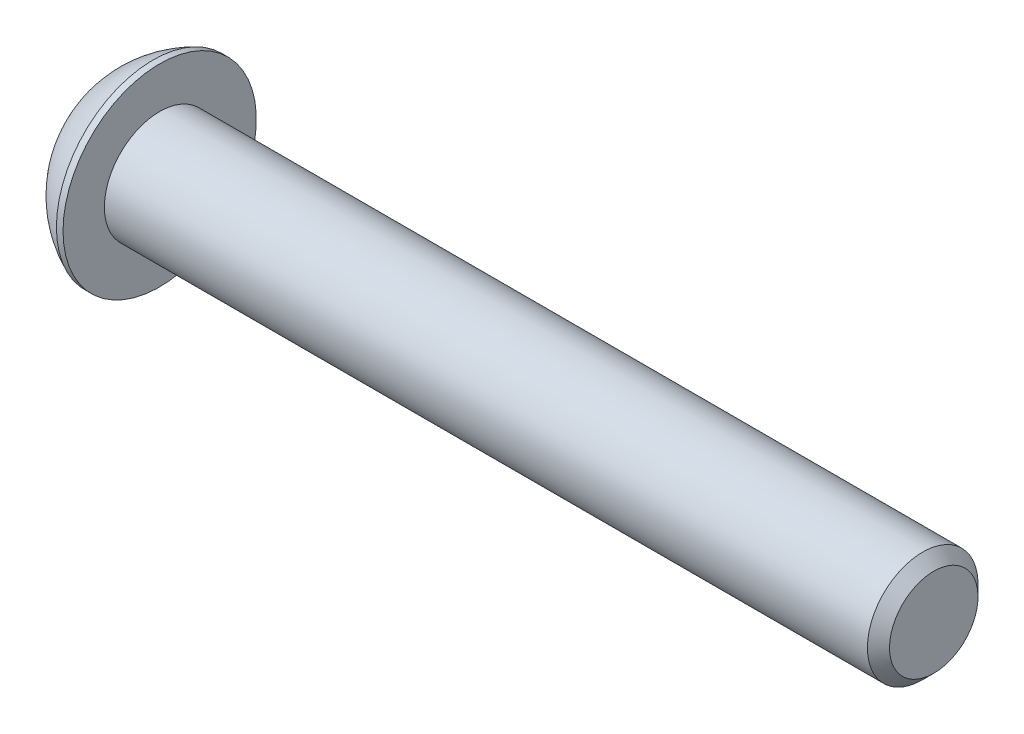
ISO-10303-21;
HEADER;
FILE_DESCRIPTION(('STEP AP214'),'2;1');
FILE_NAME('part.step','',(''),(''),'','','');
FILE_SCHEMA(('AUTOMOTIVE_DESIGN { 1 0 10303 214 1 1 1 1 }'));
ENDSEC;
DATA;
#1=APPLICATION_CONTEXT('core data for automotive mechanical design processes');
#2=APPLICATION_PROTOCOL_DEFINITION('international standard','automotive_design',2000,#1);
#3=PRODUCT_CONTEXT('',#1,'mechanical');
#4=PRODUCT('Part','Part','',(#3));
#5=PRODUCT_RELATED_PRODUCT_CATEGORY('part','',(#4));
#6=PRODUCT_DEFINITION_FORMATION('','',#4);
#7=PRODUCT_DEFINITION_CONTEXT('part definition',#1,'design');
#8=PRODUCT_DEFINITION('design','',#6,#7);
#9=PRODUCT_DEFINITION_SHAPE('','',#8);
#10=(LENGTH_UNIT() NAMED_UNIT(*) SI_UNIT(.MILLI.,.METRE.));
#11=(NAMED_UNIT(*) PLANE_ANGLE_UNIT() SI_UNIT($,.RADIAN.));
#12=(NAMED_UNIT(*) SI_UNIT($,.STERADIAN.) SOLID_ANGLE_UNIT());
#13=UNCERTAINTY_MEASURE_WITH_UNIT(LENGTH_MEASURE(1.E-05),#10,'distance_accuracy_value','');
#14=(GEOMETRIC_REPRESENTATION_CONTEXT(3) GLOBAL_UNCERTAINTY_ASSIGNED_CONTEXT((#13)) GLOBAL_UNIT_ASSIGNED_CONTEXT((#10,
#11,#12)) REPRESENTATION_CONTEXT('',''));
#15=CARTESIAN_POINT('',(0.,0.,0.));
#16=DIRECTION('',(0.,0.,1.));
#17=DIRECTION('',(1.,0.,0.));
#18=AXIS2_PLACEMENT_3D('',#15,#16,#17);
#19=CARTESIAN_POINT('',(1.32079999432833,0.,0.));
#20=DIRECTION('',(-1.,0.,0.));
#21=DIRECTION('',(0.,0.,1.));
#22=AXIS2_PLACEMENT_3D('',#19,#20,#21);
#23=CONICAL_SURFACE('',#22,1.19379999672553,1.04719755119985);
#24=CARTESIAN_POINT('',(2.01004074379096,0.,4.44089209850063E-13));
#25=VERTEX_POINT('',#24);
#26=VERTEX_LOOP('',#25);
#27=FACE_BOUND('',#26,.T.);
#28=CARTESIAN_POINT('',(1.32079999432833,0.,0.));
#29=DIRECTION('',(-1.,0.,0.));
#30=DIRECTION('',(0.,0.,1.));
#31=AXIS2_PLACEMENT_3D('',#28,#29,#30);
#32=CIRCLE('',#31,1.19379999672553);
#33=CARTESIAN_POINT('',(1.32079999432833,0.,1.19379999672553));
#34=VERTEX_POINT('',#33);
#35=EDGE_CURVE('E20',#34,#34,#32,.T.);
#36=ORIENTED_EDGE('',*,*,#35,.T.);
#37=EDGE_LOOP('',(#36));
#38=FACE_BOUND('',#37,.T.);
#39=ADVANCED_FACE('F17',(#27,#38),#23,.F.);
#40=CARTESIAN_POINT('',(1.3208,-2.29135888085,0.));
#41=DIRECTION('',(1.,0.,0.));
#42=DIRECTION('',(0.,0.,-1.));
#43=AXIS2_PLACEMENT_3D('',#40,#41,#42);
#44=PLANE('',#43);
#45=ORIENTED_EDGE('',*,*,#35,.F.);
#46=EDGE_LOOP('',(#45));
#47=FACE_BOUND('',#46,.T.);
#48=DIRECTION('',(0.,1.,0.));
#49=VECTOR('',#48,1.);
#50=CARTESIAN_POINT('',(1.3208,-1.14567944042,1.984375));
#51=LINE('',#50,#49);
#52=CARTESIAN_POINT('',(1.3208,1.1456794404025,1.984375));
#53=VERTEX_POINT('',#52);
#54=CARTESIAN_POINT('',(1.3208,-1.14567944045803,1.98437500000826));
#55=VERTEX_POINT('',#54);
#56=EDGE_CURVE('E134',#53,#55,#51,.F.);
#57=ORIENTED_EDGE('',*,*,#56,.F.);
#58=DIRECTION('',(0.,0.50000000000019,-0.866025403784329));
#59=VECTOR('',#58,1.);
#60=CARTESIAN_POINT('',(1.3208,1.14567944042,1.984375));
#61=LINE('',#60,#59);
#62=CARTESIAN_POINT('',(1.3208,2.29135888083945,1.55612149685055E-11));
#63=VERTEX_POINT('',#62);
#64=EDGE_CURVE('E116',#63,#53,#61,.F.);
#65=ORIENTED_EDGE('',*,*,#64,.F.);
#66=DIRECTION('',(0.,-0.50000000000019,-0.866025403784329));
#67=VECTOR('',#66,1.);
#68=CARTESIAN_POINT('',(1.3208,2.29135888085,0.));
#69=LINE('',#68,#67);
#70=CARTESIAN_POINT('',(1.3208,1.1456794404168,-1.98437500000826));
#71=VERTEX_POINT('',#70);
#72=EDGE_CURVE('E88',#71,#63,#69,.F.);
#73=ORIENTED_EDGE('',*,*,#72,.F.);
#74=DIRECTION('',(0.,1.,0.));
#75=VECTOR('',#74,1.);
#76=CARTESIAN_POINT('',(1.3208,1.14567944042,-1.984375));
#77=LINE('',#76,#75);
#78=CARTESIAN_POINT('',(1.3208,-1.1456794404025,-1.984375));
#79=VERTEX_POINT('',#78);
#80=EDGE_CURVE('E85',#79,#71,#77,.T.);
#81=ORIENTED_EDGE('',*,*,#80,.F.);
#82=DIRECTION('',(0.,-0.50000000000019,0.866025403784329));
#83=VECTOR('',#82,1.);
#84=CARTESIAN_POINT('',(1.3208,-1.14567944042,-1.984375));
#85=LINE('',#84,#83);
#86=CARTESIAN_POINT('',(1.3208,-2.29135888083945,-1.55606780336135E-11));
#87=VERTEX_POINT('',#86);
#88=EDGE_CURVE('E124',#87,#79,#85,.F.);
#89=ORIENTED_EDGE('',*,*,#88,.F.);
#90=DIRECTION('',(0.,0.50000000000019,0.866025403784329));
#91=VECTOR('',#90,1.);
#92=CARTESIAN_POINT('',(1.3208,-2.29135888085,0.));
#93=LINE('',#92,#91);
#94=EDGE_CURVE('E129',#55,#87,#93,.F.);
#95=ORIENTED_EDGE('',*,*,#94,.F.);
#96=EDGE_LOOP('',(#57,#65,#73,#81,#89,#95));
#97=FACE_BOUND('',#96,.T.);
#98=ADVANCED_FACE('F173',(#47,#97),#44,.F.);
#99=CARTESIAN_POINT('',(1.3208,-1.14567944042,1.984375));
#100=DIRECTION('',(0.,0.,-1.));
#101=DIRECTION('',(0.,1.,0.));
#102=AXIS2_PLACEMENT_3D('',#99,#100,#101);
#103=PLANE('',#102);
#104=ORIENTED_EDGE('',*,*,#56,.T.);
#105=DIRECTION('',(1.,0.,0.));
#106=VECTOR('',#105,1.);
#107=CARTESIAN_POINT('',(1.3208,-1.14567944040719,1.98437500003302));
#108=LINE('',#107,#106);
#109=CARTESIAN_POINT('',(0.,-1.1456794404393,1.98437500000826));
#110=VERTEX_POINT('',#109);
#111=EDGE_CURVE('E131',#110,#55,#108,.T.);
#112=ORIENTED_EDGE('',*,*,#111,.F.);
#113=DIRECTION('',(0.,1.,0.));
#114=VECTOR('',#113,1.);
#115=CARTESIAN_POINT('',(0.,0.,1.984375));
#116=LINE('',#115,#114);
#117=CARTESIAN_POINT('',(0.,1.1456794403675,1.984375));
#118=VERTEX_POINT('',#117);
#119=EDGE_CURVE('E110',#118,#110,#116,.F.);
#120=ORIENTED_EDGE('',*,*,#119,.F.);
#121=DIRECTION('',(1.,0.,0.));
#122=VECTOR('',#121,1.);
#123=CARTESIAN_POINT('',(1.3208,1.14567944042,1.984375));
#124=LINE('',#123,#122);
#125=EDGE_CURVE('E113',#53,#118,#124,.F.);
#126=ORIENTED_EDGE('',*,*,#125,.F.);
#127=EDGE_LOOP('',(#104,#112,#120,#126));
#128=FACE_BOUND('',#127,.T.);
#129=ADVANCED_FACE('F170',(#128),#103,.T.);
#130=CARTESIAN_POINT('',(1.3208,-2.29135888085,0.));
#131=DIRECTION('',(0.,0.866025403784329,-0.50000000000019));
#132=DIRECTION('',(0.,0.50000000000019,0.866025403784329));
#133=AXIS2_PLACEMENT_3D('',#130,#131,#132);
#134=PLANE('',#133);
#135=ORIENTED_EDGE('',*,*,#94,.T.);
#136=DIRECTION('',(1.,0.,0.));
#137=VECTOR('',#136,1.);
#138=CARTESIAN_POINT('',(1.3208,-2.29135888080781,-6.22431793606548E-11));
#139=LINE('',#138,#137);
#140=CARTESIAN_POINT('',(0.,-2.29135888080195,-1.55607234461392E-11));
#141=VERTEX_POINT('',#140);
#142=EDGE_CURVE('E126',#141,#87,#139,.T.);
#143=ORIENTED_EDGE('',*,*,#142,.F.);
#144=DIRECTION('',(0.,-0.499999999976052,-0.866025403798265));
#145=VECTOR('',#144,1.);
#146=CARTESIAN_POINT('',(0.,-1.14567944035,1.984375));
#147=LINE('',#146,#145);
#148=EDGE_CURVE('E105',#110,#141,#147,.T.);
#149=ORIENTED_EDGE('',*,*,#148,.F.);
#150=ORIENTED_EDGE('',*,*,#111,.T.);
#151=EDGE_LOOP('',(#135,#143,#149,#150));
#152=FACE_BOUND('',#151,.T.);
#153=ADVANCED_FACE('F166',(#152),#134,.T.);
#154=CARTESIAN_POINT('',(1.3208,-1.14567944042,-1.984375));
#155=DIRECTION('',(0.,0.866025403784329,0.50000000000019));
#156=DIRECTION('',(0.,-0.50000000000019,0.866025403784329));
#157=AXIS2_PLACEMENT_3D('',#154,#155,#156);
#158=PLANE('',#157);
#159=ORIENTED_EDGE('',*,*,#88,.T.);
#160=DIRECTION('',(1.,0.,0.));
#161=VECTOR('',#160,1.);
#162=CARTESIAN_POINT('',(1.3208,-1.14567944035,-1.984375));
#163=LINE('',#162,#161);
#164=CARTESIAN_POINT('',(0.,-1.145679440385,-1.984375));
#165=VERTEX_POINT('',#164);
#166=EDGE_CURVE('E122',#165,#79,#163,.T.);
#167=ORIENTED_EDGE('',*,*,#166,.F.);
#168=DIRECTION('',(0.,0.499999999976052,-0.866025403798265));
#169=VECTOR('',#168,1.);
#170=CARTESIAN_POINT('',(0.,-2.2913588807,0.));
#171=LINE('',#170,#169);
#172=EDGE_CURVE('E103',#141,#165,#171,.T.);
#173=ORIENTED_EDGE('',*,*,#172,.F.);
#174=ORIENTED_EDGE('',*,*,#142,.T.);
#175=EDGE_LOOP('',(#159,#167,#173,#174));
#176=FACE_BOUND('',#175,.T.);
#177=ADVANCED_FACE('F163',(#176),#158,.T.);
#178=CARTESIAN_POINT('',(1.3208,1.14567944042,-1.984375));
#179=DIRECTION('',(0.,0.,1.));
#180=DIRECTION('',(1.,0.,0.));
#181=AXIS2_PLACEMENT_3D('',#178,#179,#180);
#182=PLANE('',#181);
#183=ORIENTED_EDGE('',*,*,#80,.T.);
#184=DIRECTION('',(1.,0.,0.));
#185=VECTOR('',#184,1.);
#186=CARTESIAN_POINT('',(1.3208,1.14567944040719,-1.98437500003302));
#187=LINE('',#186,#185);
#188=CARTESIAN_POINT('',(0.,1.1456794403993,-1.98437500000826));
#189=VERTEX_POINT('',#188);
#190=EDGE_CURVE('E77',#189,#71,#187,.T.);
#191=ORIENTED_EDGE('',*,*,#190,.F.);
#192=DIRECTION('',(0.,1.,0.));
#193=VECTOR('',#192,1.);
#194=CARTESIAN_POINT('',(0.,0.,-1.984375));
#195=LINE('',#194,#193);
#196=EDGE_CURVE('E82',#165,#189,#195,.T.);
#197=ORIENTED_EDGE('',*,*,#196,.F.);
#198=ORIENTED_EDGE('',*,*,#166,.T.);
#199=EDGE_LOOP('',(#183,#191,#197,#198));
#200=FACE_BOUND('',#199,.T.);
#201=ADVANCED_FACE('F79',(#200),#182,.T.);
#202=CARTESIAN_POINT('',(1.3208,2.29135888085,0.));
#203=DIRECTION('',(0.,-0.866025403784329,0.50000000000019));
#204=DIRECTION('',(0.,-0.50000000000019,-0.866025403784329));
#205=AXIS2_PLACEMENT_3D('',#202,#203,#204);
#206=PLANE('',#205);
#207=ORIENTED_EDGE('',*,*,#72,.T.);
#208=DIRECTION('',(1.,0.,0.));
#209=VECTOR('',#208,1.);
#210=CARTESIAN_POINT('',(1.3208,2.29135888080781,6.22431793606548E-11));
#211=LINE('',#210,#209);
#212=CARTESIAN_POINT('',(0.,2.29135888080195,1.55609402865737E-11));
#213=VERTEX_POINT('',#212);
#214=EDGE_CURVE('E94',#213,#63,#211,.T.);
#215=ORIENTED_EDGE('',*,*,#214,.F.);
#216=DIRECTION('',(0.,0.499999999976052,0.866025403798265));
#217=VECTOR('',#216,1.);
#218=CARTESIAN_POINT('',(0.,1.14567944035,-1.984375));
#219=LINE('',#218,#217);
#220=EDGE_CURVE('E91',#189,#213,#219,.T.);
#221=ORIENTED_EDGE('',*,*,#220,.F.);
#222=ORIENTED_EDGE('',*,*,#190,.T.);
#223=EDGE_LOOP('',(#207,#215,#221,#222));
#224=FACE_BOUND('',#223,.T.);
#225=ADVANCED_FACE('F92',(#224),#206,.T.);
#226=CARTESIAN_POINT('',(1.3208,1.14567944042,1.984375));
#227=DIRECTION('',(0.,-0.866025403784329,-0.50000000000019));
#228=DIRECTION('',(0.,0.50000000000019,-0.866025403784329));
#229=AXIS2_PLACEMENT_3D('',#226,#227,#228);
#230=PLANE('',#229);
#231=ORIENTED_EDGE('',*,*,#64,.T.);
#232=ORIENTED_EDGE('',*,*,#125,.T.);
#233=DIRECTION('',(0.,-0.499999999976052,0.866025403798265));
#234=VECTOR('',#233,1.);
#235=CARTESIAN_POINT('',(0.,2.2913588807,0.));
#236=LINE('',#235,#234);
#237=EDGE_CURVE('E98',#213,#118,#236,.T.);
#238=ORIENTED_EDGE('',*,*,#237,.F.);
#239=ORIENTED_EDGE('',*,*,#214,.T.);
#240=EDGE_LOOP('',(#231,#232,#238,#239));
#241=FACE_BOUND('',#240,.T.);
#242=ADVANCED_FACE('F155',(#241),#230,.T.);
#243=CARTESIAN_POINT('',(0.,0.,0.));
#244=DIRECTION('',(-1.,0.,0.));
#245=DIRECTION('',(0.,0.,1.));
#246=AXIS2_PLACEMENT_3D('',#243,#244,#245);
#247=PLANE('',#246);
#248=ORIENTED_EDGE('',*,*,#220,.T.);
#249=ORIENTED_EDGE('',*,*,#237,.T.);
#250=ORIENTED_EDGE('',*,*,#119,.T.);
#251=ORIENTED_EDGE('',*,*,#148,.T.);
#252=ORIENTED_EDGE('',*,*,#172,.T.);
#253=ORIENTED_EDGE('',*,*,#196,.T.);
#254=EDGE_LOOP('',(#248,#249,#250,#251,#252,#253));
#255=FACE_BOUND('',#254,.T.);
#256=CARTESIAN_POINT('',(0.,0.,2.77495000000498));
#257=CARTESIAN_POINT('',(0.,-0.0780476189418023,2.7749574777346));
#258=CARTESIAN_POINT('',(0.,-0.156091690997,2.77165730271175));
#259=CARTESIAN_POINT('',(0.,-0.311621483993028,2.75849951311291));
#260=CARTESIAN_POINT('',(0.,-0.38910723148015,2.74864221241182));
#261=CARTESIAN_POINT('',(0.,-0.542923175998717,2.72243714479626));
#262=CARTESIAN_POINT('',(0.,-0.619254139371762,2.70609389762394));
#263=CARTESIAN_POINT('',(0.,-0.770249304507315,2.66704952043296));
#264=CARTESIAN_POINT('',(0.,-0.844913526539225,2.64434846777771));
#265=CARTESIAN_POINT('',(0.,-1.06568596776161,2.5668918761079));
#266=CARTESIAN_POINT('',(0.,-1.20863620572707,2.50277224258278));
#267=CARTESIAN_POINT('',(0.,-1.48162845017614,2.35149042805168));
#268=CARTESIAN_POINT('',(0.,-1.61167355634549,2.26433379882055));
#269=CARTESIAN_POINT('',(0.,-1.85530048203785,2.06942681171443));
#270=CARTESIAN_POINT('',(0.,-1.96888346338675,1.96167790839914));
#271=CARTESIAN_POINT('',(0.,-2.17638612604483,1.72859715533842));
#272=CARTESIAN_POINT('',(0.,-2.27029827782891,1.60325860323943));
#273=CARTESIAN_POINT('',(0.,-2.43577545577329,1.33855376914359));
#274=CARTESIAN_POINT('',(0.,-2.50733172131476,1.19918201616334));
#275=CARTESIAN_POINT('',(0.,-2.62594987301431,0.910512315267797));
#276=CARTESIAN_POINT('',(0.,-2.67304017955261,0.761226112752659));
#277=CARTESIAN_POINT('',(0.,-2.72974480799017,0.509262206015232));
#278=CARTESIAN_POINT('',(0.,-2.7466741066797,0.408170256195464));
#279=CARTESIAN_POINT('',(0.,-2.76927900228181,0.204733741062011));
#280=CARTESIAN_POINT('',(0.,-2.77495436270396,0.102389149470764));
#281=CARTESIAN_POINT('',(0.,-2.77494335790323,-0.1558849582706));
#282=CARTESIAN_POINT('',(-3.37327630179731E-13,-2.76177150806704,-0.31187319864273));
#283=CARTESIAN_POINT('',(3.38562160741123E-13,-2.70941293854891,-0.619540159108329));
#284=CARTESIAN_POINT('',(1.27983070085801E-12,-2.67019795455288,-0.771214010135769));
#285=CARTESIAN_POINT('',(1.28221982382751E-12,-2.56687014830246,-1.0657693076378));
#286=CARTESIAN_POINT('',(3.44164875918747E-13,-2.50276825401477,-1.20865458136379));
#287=CARTESIAN_POINT('',(-3.43225758051063E-13,-2.35149927682559,-1.48160130773281));
#288=CARTESIAN_POINT('',(0.,-2.26433701172623,-1.61166543120533));
#289=CARTESIAN_POINT('',(0.,-2.06941027445284,-1.85532526242913));
#290=CARTESIAN_POINT('',(0.,-1.96164444068513,-1.96891988091485));
#291=CARTESIAN_POINT('',(0.,-1.72855917863899,-2.176413309275));
#292=CARTESIAN_POINT('',(0.,-1.60323840676039,-2.27031061020308));
#293=CARTESIAN_POINT('',(0.,-1.33859668560166,-2.43574892033037));
#294=CARTESIAN_POINT('',(0.,-1.19927266628187,-2.50728501291905));
#295=CARTESIAN_POINT('',(0.,-0.910609613461349,-2.62591932801922));
#296=CARTESIAN_POINT('',(0.,-0.761275783745211,-2.67303013888595));
#297=CARTESIAN_POINT('',(0.,-0.509186402769317,-2.72976111987087));
#298=CARTESIAN_POINT('',(0.,-0.408016727031738,-2.74669741402727));
#299=CARTESIAN_POINT('',(0.,-0.204578776250972,-2.76928996300059));
#300=CARTESIAN_POINT('',(0.,-0.102312365024706,-2.77496300589831));
#301=CARTESIAN_POINT('',(0.,0.,-2.77495000000498));
#302=B_SPLINE_CURVE_WITH_KNOTS('',3,(#256,#257,#258,#259,#260,#261,#262,#263,#264,#265,#266,
#267,#268,#269,#270,#271,#272,#273,#274,#275,#276,#277,#278,#279,#280,#281,#282,#283,#284,#285,
#286,#287,#288,#289,#290,#291,#292,#293,#294,#295,#296,#297,#298,#299,#300,#301),.UNSPECIFIED.,
.F.,.F.,(4,2,2,2,2,2,2,2,2,2,2,2,2,2,2,2,2,2,2,2,2,2,4),(0.,0.234066711495954,0.468122219550207,
0.702014911241611,0.935904756990152,1.40349738510624,1.87097742884399,2.33842446377097,
2.80605010062436,3.27385875712272,3.74112277139293,4.0480390880636,4.35496185421012,
4.8222442062987,5.29003452512533,5.75761966678295,6.22510719699141,6.69262563195384,
7.16017986888879,7.62783683586065,8.09525254056861,8.40240115938039,8.70909162286251),.UNSPECIFIED.);
#303=CARTESIAN_POINT('',(0.,0.,2.77495000000498));
#304=VERTEX_POINT('',#303);
#305=CARTESIAN_POINT('',(0.,0.,-2.77495000000498));
#306=VERTEX_POINT('',#305);
#307=EDGE_CURVE('E32',#304,#306,#302,.T.);
#308=ORIENTED_EDGE('',*,*,#307,.F.);
#309=CARTESIAN_POINT('',(0.,0.,0.));
#310=DIRECTION('',(-1.,0.,0.));
#311=DIRECTION('',(0.,-1.,0.));
#312=AXIS2_PLACEMENT_3D('',#309,#310,#311);
#313=CIRCLE('',#312,2.77495000000498);
#314=EDGE_CURVE('E35',#306,#304,#313,.F.);
#315=ORIENTED_EDGE('',*,*,#314,.F.);
#316=EDGE_LOOP('',(#308,#315));
#317=FACE_BOUND('',#316,.T.);
#318=ADVANCED_FACE('F100',(#255,#317),#247,.T.);
#319=CARTESIAN_POINT('',(5.3726088141,0.,0.));
#320=DIRECTION('',(-1.,0.,0.));
#321=DIRECTION('',(0.,1.,0.));
#322=AXIS2_PLACEMENT_3D('',#319,#320,#321);
#323=SPHERICAL_SURFACE('',#322,6.04692260343);
#324=ORIENTED_EDGE('',*,*,#314,.T.);
#325=ORIENTED_EDGE('',*,*,#307,.T.);
#326=EDGE_LOOP('',(#324,#325));
#327=FACE_BOUND('',#326,.T.);
#328=CARTESIAN_POINT('',(2.97179999948,0.,0.));
#329=DIRECTION('',(-1.,0.,0.));
#330=DIRECTION('',(0.,0.,1.));
#331=AXIS2_PLACEMENT_3D('',#328,#329,#330);
#332=CIRCLE('',#331,5.5499);
#333=CARTESIAN_POINT('',(2.97179999948,0.,5.5499));
#334=VERTEX_POINT('',#333);
#335=EDGE_CURVE('E142',#334,#334,#332,.F.);
#336=ORIENTED_EDGE('',*,*,#335,.F.);
#337=EDGE_LOOP('',(#336));
#338=FACE_BOUND('',#337,.T.);
#339=ADVANCED_FACE('F154',(#327,#338),#323,.T.);
#340=CARTESIAN_POINT('',(47.8028,0.,0.));
#341=DIRECTION('',(-1.,0.,0.));
#342=DIRECTION('',(0.,0.,1.));
#343=AXIS2_PLACEMENT_3D('',#340,#341,#342);
#344=PLANE('',#343);
#345=CARTESIAN_POINT('',(47.8027999999995,0.,0.));
#346=DIRECTION('',(-1.,0.,0.));
#347=DIRECTION('',(0.,-1.,0.));
#348=AXIS2_PLACEMENT_3D('',#345,#346,#347);
#349=CIRCLE('',#348,2.54000000006727);
#350=CARTESIAN_POINT('',(47.8027999999995,-2.54000000006727,0.));
#351=VERTEX_POINT('',#350);
#352=EDGE_CURVE('E139',#351,#351,#349,.T.);
#353=ORIENTED_EDGE('',*,*,#352,.F.);
#354=EDGE_LOOP('',(#353));
#355=FACE_BOUND('',#354,.T.);
#356=ADVANCED_FACE('F203',(#355),#344,.F.);
#357=CARTESIAN_POINT('',(0.,0.,0.));
#358=DIRECTION('',(-1.,0.,0.));
#359=DIRECTION('',(0.,0.,1.));
#360=AXIS2_PLACEMENT_3D('',#357,#358,#359);
#361=CYLINDRICAL_SURFACE('',#360,5.5499);
#362=ORIENTED_EDGE('',*,*,#335,.T.);
#363=EDGE_LOOP('',(#362));
#364=FACE_BOUND('',#363,.T.);
#365=CARTESIAN_POINT('',(3.35280000046,0.,0.));
#366=DIRECTION('',(-1.,0.,0.));
#367=DIRECTION('',(0.,0.,1.));
#368=AXIS2_PLACEMENT_3D('',#365,#366,#367);
#369=CIRCLE('',#368,5.5499);
#370=CARTESIAN_POINT('',(3.35280000046,0.,5.5499));
#371=VERTEX_POINT('',#370);
#372=EDGE_CURVE('E136',#371,#371,#369,.T.);
#373=ORIENTED_EDGE('',*,*,#372,.T.);
#374=EDGE_LOOP('',(#373));
#375=FACE_BOUND('',#374,.T.);
#376=ADVANCED_FACE('F199',(#364,#375),#361,.T.);
#377=CARTESIAN_POINT('',(47.1678000001248,0.,0.));
#378=DIRECTION('',(-1.,0.,0.));
#379=DIRECTION('',(0.,-1.,0.));
#380=AXIS2_PLACEMENT_3D('',#377,#378,#379);
#381=CONICAL_SURFACE('',#380,3.17499999988513,0.78539816335269);
#382=CARTESIAN_POINT('',(47.1678,0.,0.));
#383=DIRECTION('',(-1.,0.,0.));
#384=DIRECTION('',(0.,0.,1.));
#385=AXIS2_PLACEMENT_3D('',#382,#383,#384);
#386=CIRCLE('',#385,3.175);
#387=CARTESIAN_POINT('',(47.1678,0.,3.175));
#388=VERTEX_POINT('',#387);
#389=EDGE_CURVE('E25',#388,#388,#386,.T.);
#390=ORIENTED_EDGE('',*,*,#389,.F.);
#391=EDGE_LOOP('',(#390));
#392=FACE_BOUND('',#391,.T.);
#393=ORIENTED_EDGE('',*,*,#352,.T.);
#394=EDGE_LOOP('',(#393));
#395=FACE_BOUND('',#394,.T.);
#396=ADVANCED_FACE('F192',(#392,#395),#381,.T.);
#397=CARTESIAN_POINT('',(3.3528,3.175,0.));
#398=DIRECTION('',(-1.,0.,0.));
#399=DIRECTION('',(0.,0.,1.));
#400=AXIS2_PLACEMENT_3D('',#397,#398,#399);
#401=PLANE('',#400);
#402=CARTESIAN_POINT('',(3.35280000046,0.,0.));
#403=DIRECTION('',(-1.,0.,0.));
#404=DIRECTION('',(0.,0.,1.));
#405=AXIS2_PLACEMENT_3D('',#402,#403,#404);
#406=CIRCLE('',#405,3.175);
#407=CARTESIAN_POINT('',(3.35280000046,0.,3.175));
#408=VERTEX_POINT('',#407);
#409=EDGE_CURVE('E11',#408,#408,#406,.F.);
#410=ORIENTED_EDGE('',*,*,#409,.F.);
#411=EDGE_LOOP('',(#410));
#412=FACE_BOUND('',#411,.T.);
#413=ORIENTED_EDGE('',*,*,#372,.F.);
#414=EDGE_LOOP('',(#413));
#415=FACE_BOUND('',#414,.T.);
#416=ADVANCED_FACE('F186',(#412,#415),#401,.F.);
#417=CARTESIAN_POINT('',(0.,0.,0.));
#418=DIRECTION('',(-1.,0.,0.));
#419=DIRECTION('',(0.,0.,1.));
#420=AXIS2_PLACEMENT_3D('',#417,#418,#419);
#421=CYLINDRICAL_SURFACE('',#420,3.175);
#422=ORIENTED_EDGE('',*,*,#409,.T.);
#423=EDGE_LOOP('',(#422));
#424=FACE_BOUND('',#423,.T.);
#425=ORIENTED_EDGE('',*,*,#389,.T.);
#426=EDGE_LOOP('',(#425));
#427=FACE_BOUND('',#426,.T.);
#428=ADVANCED_FACE('F184',(#424,#427),#421,.T.);
#429=CLOSED_SHELL('',(#39,#98,#129,#153,#177,#201,#225,#242,#318,#339,#356,#376,#396,#416,#428));
#430=MANIFOLD_SOLID_BREP('B1',#429);
#431=ADVANCED_BREP_SHAPE_REPRESENTATION('',(#18,#430),#14);
#432=SHAPE_DEFINITION_REPRESENTATION(#9,#431);
ENDSEC;
END-ISO-10303-21;
